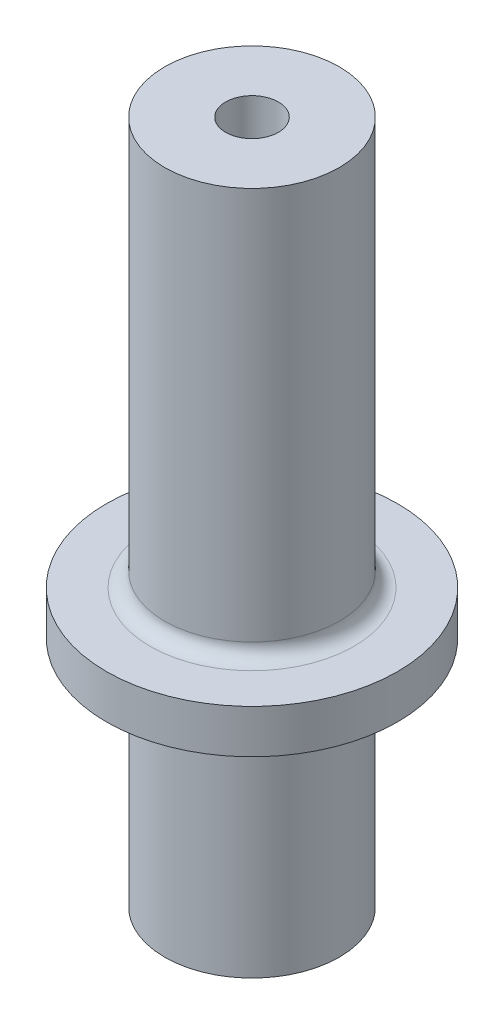
ISO-10303-21;
HEADER;
FILE_DESCRIPTION(('STEP AP214'),'2;1');
FILE_NAME('part.step','',(''),(''),'','','');
FILE_SCHEMA(('AUTOMOTIVE_DESIGN { 1 0 10303 214 1 1 1 1 }'));
ENDSEC;
DATA;
#1=APPLICATION_CONTEXT('core data for automotive mechanical design processes');
#2=APPLICATION_PROTOCOL_DEFINITION('international standard','automotive_design',2000,#1);
#3=PRODUCT_CONTEXT('',#1,'mechanical');
#4=PRODUCT('Part','Part','',(#3));
#5=PRODUCT_RELATED_PRODUCT_CATEGORY('part','',(#4));
#6=PRODUCT_DEFINITION_FORMATION('','',#4);
#7=PRODUCT_DEFINITION_CONTEXT('part definition',#1,'design');
#8=PRODUCT_DEFINITION('design','',#6,#7);
#9=PRODUCT_DEFINITION_SHAPE('','',#8);
#10=(LENGTH_UNIT() NAMED_UNIT(*) SI_UNIT(.MILLI.,.METRE.));
#11=(NAMED_UNIT(*) PLANE_ANGLE_UNIT() SI_UNIT($,.RADIAN.));
#12=(NAMED_UNIT(*) SI_UNIT($,.STERADIAN.) SOLID_ANGLE_UNIT());
#13=UNCERTAINTY_MEASURE_WITH_UNIT(LENGTH_MEASURE(1.E-05),#10,'distance_accuracy_value','');
#14=(GEOMETRIC_REPRESENTATION_CONTEXT(3) GLOBAL_UNCERTAINTY_ASSIGNED_CONTEXT((#13)) GLOBAL_UNIT_ASSIGNED_CONTEXT((#10,
#11,#12)) REPRESENTATION_CONTEXT('',''));
#15=CARTESIAN_POINT('',(0.,0.,0.));
#16=DIRECTION('',(0.,0.,1.));
#17=DIRECTION('',(1.,0.,0.));
#18=AXIS2_PLACEMENT_3D('',#15,#16,#17);
#19=CARTESIAN_POINT('',(0.,-53.766632852948,0.));
#20=DIRECTION('',(0.,-1.,0.));
#21=DIRECTION('',(0.,0.,-1.));
#22=AXIS2_PLACEMENT_3D('',#19,#20,#21);
#23=PLANE('',#22);
#24=CARTESIAN_POINT('',(0.,-53.766632852948,0.));
#25=DIRECTION('',(0.,1.,0.));
#26=DIRECTION('',(0.,0.,1.));
#27=AXIS2_PLACEMENT_3D('',#24,#25,#26);
#28=CIRCLE('',#27,19.05);
#29=CARTESIAN_POINT('',(0.,-53.766632852948,19.05));
#30=VERTEX_POINT('',#29);
#31=EDGE_CURVE('E89',#30,#30,#28,.T.);
#32=ORIENTED_EDGE('',*,*,#31,.F.);
#33=EDGE_LOOP('',(#32));
#34=FACE_BOUND('',#33,.T.);
#35=ADVANCED_FACE('F48',(#34),#23,.T.);
#36=CARTESIAN_POINT('',(0.,95.458367147052,0.));
#37=DIRECTION('',(0.,1.,0.));
#38=DIRECTION('',(0.,0.,1.));
#39=AXIS2_PLACEMENT_3D('',#36,#37,#38);
#40=CYLINDRICAL_SURFACE('',#39,19.05);
#41=CARTESIAN_POINT('',(0.,-6.14163285294796,0.));
#42=DIRECTION('',(0.,-1.,0.));
#43=DIRECTION('',(0.,0.,-1.));
#44=AXIS2_PLACEMENT_3D('',#41,#42,#43);
#45=CIRCLE('',#44,19.05);
#46=CARTESIAN_POINT('',(0.,-6.14163285294796,-19.05));
#47=VERTEX_POINT('',#46);
#48=EDGE_CURVE('E96',#47,#47,#45,.T.);
#49=ORIENTED_EDGE('',*,*,#48,.T.);
#50=EDGE_LOOP('',(#49));
#51=FACE_BOUND('',#50,.T.);
#52=ORIENTED_EDGE('',*,*,#31,.T.);
#53=EDGE_LOOP('',(#52));
#54=FACE_BOUND('',#53,.T.);
#55=ADVANCED_FACE('F115',(#51,#54),#40,.T.);
#56=CARTESIAN_POINT('',(-31.75,-2.96663285294795,0.));
#57=DIRECTION('',(0.,-1.,0.));
#58=DIRECTION('',(0.,0.,-1.));
#59=AXIS2_PLACEMENT_3D('',#56,#57,#58);
#60=PLANE('',#59);
#61=CARTESIAN_POINT('',(0.,-2.96663285294795,0.));
#62=DIRECTION('',(0.,-1.,0.));
#63=DIRECTION('',(0.,0.,-1.));
#64=AXIS2_PLACEMENT_3D('',#61,#62,#63);
#65=CIRCLE('',#64,22.225);
#66=CARTESIAN_POINT('',(0.,-2.96663285294795,-22.225));
#67=VERTEX_POINT('',#66);
#68=EDGE_CURVE('E93',#67,#67,#65,.F.);
#69=ORIENTED_EDGE('',*,*,#68,.T.);
#70=EDGE_LOOP('',(#69));
#71=FACE_BOUND('',#70,.T.);
#72=CARTESIAN_POINT('',(0.,-2.96663285294796,0.));
#73=DIRECTION('',(0.,1.,0.));
#74=DIRECTION('',(0.,0.,1.));
#75=AXIS2_PLACEMENT_3D('',#72,#73,#74);
#76=CIRCLE('',#75,31.75);
#77=CARTESIAN_POINT('',(0.,-2.96663285294796,31.75));
#78=VERTEX_POINT('',#77);
#79=EDGE_CURVE('E85',#78,#78,#76,.T.);
#80=ORIENTED_EDGE('',*,*,#79,.F.);
#81=EDGE_LOOP('',(#80));
#82=FACE_BOUND('',#81,.T.);
#83=ADVANCED_FACE('F121',(#71,#82),#60,.T.);
#84=CARTESIAN_POINT('',(0.,95.458367147052,0.));
#85=DIRECTION('',(0.,1.,0.));
#86=DIRECTION('',(0.,0.,1.));
#87=AXIS2_PLACEMENT_3D('',#84,#85,#86);
#88=CYLINDRICAL_SURFACE('',#87,31.75);
#89=ORIENTED_EDGE('',*,*,#79,.T.);
#90=EDGE_LOOP('',(#89));
#91=FACE_BOUND('',#90,.T.);
#92=CARTESIAN_POINT('',(0.,6.55836714705205,0.));
#93=DIRECTION('',(0.,1.,0.));
#94=DIRECTION('',(0.,0.,1.));
#95=AXIS2_PLACEMENT_3D('',#92,#93,#94);
#96=CIRCLE('',#95,31.75);
#97=CARTESIAN_POINT('',(0.,6.55836714705205,31.75));
#98=VERTEX_POINT('',#97);
#99=EDGE_CURVE('E76',#98,#98,#96,.T.);
#100=ORIENTED_EDGE('',*,*,#99,.F.);
#101=EDGE_LOOP('',(#100));
#102=FACE_BOUND('',#101,.T.);
#103=ADVANCED_FACE('F128',(#91,#102),#88,.T.);
#104=CARTESIAN_POINT('',(-31.75,6.55836714705205,0.));
#105=DIRECTION('',(0.,1.,0.));
#106=DIRECTION('',(0.,0.,1.));
#107=AXIS2_PLACEMENT_3D('',#104,#105,#106);
#108=PLANE('',#107);
#109=CARTESIAN_POINT('',(0.,6.55836714705205,0.));
#110=DIRECTION('',(0.,1.,0.));
#111=DIRECTION('',(0.,0.,1.));
#112=AXIS2_PLACEMENT_3D('',#109,#110,#111);
#113=CIRCLE('',#112,22.225);
#114=CARTESIAN_POINT('',(0.,6.55836714705205,22.225));
#115=VERTEX_POINT('',#114);
#116=EDGE_CURVE('E11',#115,#115,#113,.F.);
#117=ORIENTED_EDGE('',*,*,#116,.T.);
#118=EDGE_LOOP('',(#117));
#119=FACE_BOUND('',#118,.T.);
#120=ORIENTED_EDGE('',*,*,#99,.T.);
#121=EDGE_LOOP('',(#120));
#122=FACE_BOUND('',#121,.T.);
#123=ADVANCED_FACE('F132',(#119,#122),#108,.T.);
#124=CARTESIAN_POINT('',(0.,95.458367147052,0.));
#125=DIRECTION('',(0.,1.,0.));
#126=DIRECTION('',(0.,0.,1.));
#127=AXIS2_PLACEMENT_3D('',#124,#125,#126);
#128=CYLINDRICAL_SURFACE('',#127,19.05);
#129=CARTESIAN_POINT('',(0.,9.73336714705204,0.));
#130=DIRECTION('',(0.,1.,0.));
#131=DIRECTION('',(0.,0.,1.));
#132=AXIS2_PLACEMENT_3D('',#129,#130,#131);
#133=CIRCLE('',#132,19.05);
#134=CARTESIAN_POINT('',(0.,9.73336714705204,19.05));
#135=VERTEX_POINT('',#134);
#136=EDGE_CURVE('E56',#135,#135,#133,.T.);
#137=ORIENTED_EDGE('',*,*,#136,.T.);
#138=EDGE_LOOP('',(#137));
#139=FACE_BOUND('',#138,.T.);
#140=CARTESIAN_POINT('',(0.,95.458367147052,0.));
#141=DIRECTION('',(0.,1.,0.));
#142=DIRECTION('',(0.,0.,1.));
#143=AXIS2_PLACEMENT_3D('',#140,#141,#142);
#144=CIRCLE('',#143,19.05);
#145=CARTESIAN_POINT('',(0.,95.458367147052,19.05));
#146=VERTEX_POINT('',#145);
#147=EDGE_CURVE('E70',#146,#146,#144,.T.);
#148=ORIENTED_EDGE('',*,*,#147,.F.);
#149=EDGE_LOOP('',(#148));
#150=FACE_BOUND('',#149,.T.);
#151=ADVANCED_FACE('F103',(#139,#150),#128,.T.);
#152=CARTESIAN_POINT('',(-19.05,95.458367147052,0.));
#153=DIRECTION('',(0.,1.,0.));
#154=DIRECTION('',(0.,0.,1.));
#155=AXIS2_PLACEMENT_3D('',#152,#153,#154);
#156=PLANE('',#155);
#157=CARTESIAN_POINT('',(0.,95.458367147052,0.));
#158=DIRECTION('',(0.,1.,0.));
#159=DIRECTION('',(0.,0.,1.));
#160=AXIS2_PLACEMENT_3D('',#157,#158,#159);
#161=CIRCLE('',#160,5.75437);
#162=CARTESIAN_POINT('',(0.,95.458367147052,5.75437));
#163=VERTEX_POINT('',#162);
#164=EDGE_CURVE('E71',#163,#163,#161,.T.);
#165=ORIENTED_EDGE('',*,*,#164,.F.);
#166=EDGE_LOOP('',(#165));
#167=FACE_BOUND('',#166,.T.);
#168=ORIENTED_EDGE('',*,*,#147,.T.);
#169=EDGE_LOOP('',(#168));
#170=FACE_BOUND('',#169,.T.);
#171=ADVANCED_FACE('F63',(#167,#170),#156,.T.);
#172=CARTESIAN_POINT('',(0.,66.248367147052,0.));
#173=DIRECTION('',(0.,1.,0.));
#174=DIRECTION('',(0.,0.,1.));
#175=AXIS2_PLACEMENT_3D('',#172,#173,#174);
#176=CONICAL_SURFACE('',#175,5.75436999999999,1.02974425867665);
#177=CARTESIAN_POINT('',(0.,62.7907928267384,0.));
#178=VERTEX_POINT('',#177);
#179=VERTEX_LOOP('',#178);
#180=FACE_BOUND('',#179,.T.);
#181=CARTESIAN_POINT('',(0.,66.248367147052,0.));
#182=DIRECTION('',(0.,1.,0.));
#183=DIRECTION('',(0.,0.,1.));
#184=AXIS2_PLACEMENT_3D('',#181,#182,#183);
#185=CIRCLE('',#184,5.75436999999999);
#186=CARTESIAN_POINT('',(0.,66.248367147052,5.75436999999999));
#187=VERTEX_POINT('',#186);
#188=EDGE_CURVE('E67',#187,#187,#185,.T.);
#189=ORIENTED_EDGE('',*,*,#188,.T.);
#190=EDGE_LOOP('',(#189));
#191=FACE_BOUND('',#190,.T.);
#192=ADVANCED_FACE('F59',(#180,#191),#176,.F.);
#193=CARTESIAN_POINT('',(0.,95.458367147052,0.));
#194=DIRECTION('',(0.,1.,0.));
#195=DIRECTION('',(0.,0.,1.));
#196=AXIS2_PLACEMENT_3D('',#193,#194,#195);
#197=CYLINDRICAL_SURFACE('',#196,5.75437);
#198=ORIENTED_EDGE('',*,*,#188,.F.);
#199=EDGE_LOOP('',(#198));
#200=FACE_BOUND('',#199,.T.);
#201=ORIENTED_EDGE('',*,*,#164,.T.);
#202=EDGE_LOOP('',(#201));
#203=FACE_BOUND('',#202,.T.);
#204=ADVANCED_FACE('F62',(#200,#203),#197,.F.);
#205=CARTESIAN_POINT('',(0.,-6.14163285294796,0.));
#206=DIRECTION('',(0.,-1.,0.));
#207=DIRECTION('',(0.,0.,-1.));
#208=AXIS2_PLACEMENT_3D('',#205,#206,#207);
#209=TOROIDAL_SURFACE('',#208,22.225,3.175);
#210=ORIENTED_EDGE('',*,*,#48,.F.);
#211=EDGE_LOOP('',(#210));
#212=FACE_BOUND('',#211,.T.);
#213=ORIENTED_EDGE('',*,*,#68,.F.);
#214=EDGE_LOOP('',(#213));
#215=FACE_BOUND('',#214,.T.);
#216=ADVANCED_FACE('F107',(#212,#215),#209,.F.);
#217=CARTESIAN_POINT('',(0.,9.73336714705204,0.));
#218=DIRECTION('',(0.,1.,0.));
#219=DIRECTION('',(0.,0.,1.));
#220=AXIS2_PLACEMENT_3D('',#217,#218,#219);
#221=TOROIDAL_SURFACE('',#220,22.225,3.175);
#222=ORIENTED_EDGE('',*,*,#116,.F.);
#223=EDGE_LOOP('',(#222));
#224=FACE_BOUND('',#223,.T.);
#225=ORIENTED_EDGE('',*,*,#136,.F.);
#226=EDGE_LOOP('',(#225));
#227=FACE_BOUND('',#226,.T.);
#228=ADVANCED_FACE('F50',(#224,#227),#221,.F.);
#229=CLOSED_SHELL('',(#35,#55,#83,#103,#123,#151,#171,#192,#204,#216,#228));
#230=MANIFOLD_SOLID_BREP('B2',#229);
#231=ADVANCED_BREP_SHAPE_REPRESENTATION('',(#18,#230),#14);
#232=SHAPE_DEFINITION_REPRESENTATION(#9,#231);
ENDSEC;
END-ISO-10303-21;
